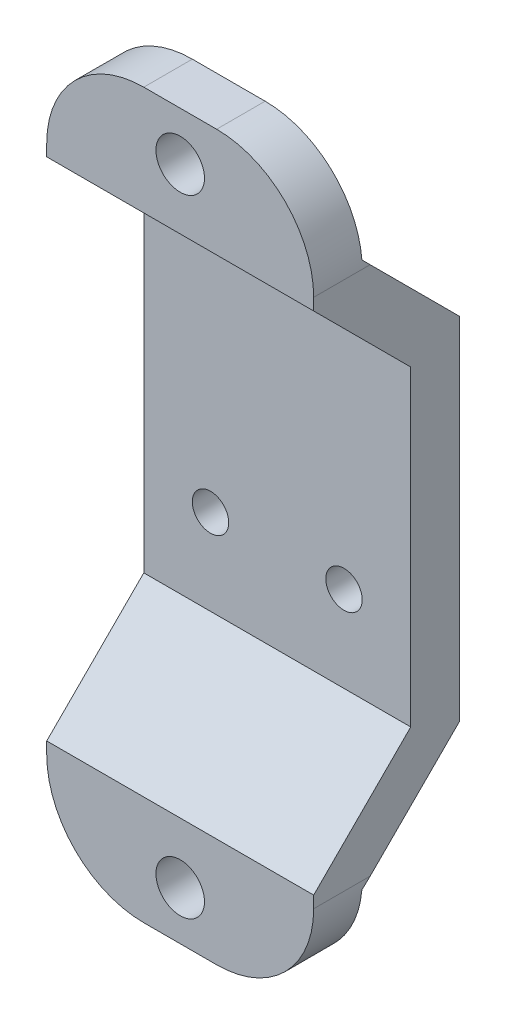
ISO-10303-21;
HEADER;
FILE_DESCRIPTION(('STEP AP214'),'2;1');
FILE_NAME('part.step','',(''),(''),'','','');
FILE_SCHEMA(('AUTOMOTIVE_DESIGN { 1 0 10303 214 1 1 1 1 }'));
ENDSEC;
DATA;
#1=APPLICATION_CONTEXT('core data for automotive mechanical design processes');
#2=APPLICATION_PROTOCOL_DEFINITION('international standard','automotive_design',2000,#1);
#3=PRODUCT_CONTEXT('',#1,'mechanical');
#4=PRODUCT('Part','Part','',(#3));
#5=PRODUCT_RELATED_PRODUCT_CATEGORY('part','',(#4));
#6=PRODUCT_DEFINITION_FORMATION('','',#4);
#7=PRODUCT_DEFINITION_CONTEXT('part definition',#1,'design');
#8=PRODUCT_DEFINITION('design','',#6,#7);
#9=PRODUCT_DEFINITION_SHAPE('','',#8);
#10=(LENGTH_UNIT() NAMED_UNIT(*) SI_UNIT(.MILLI.,.METRE.));
#11=(NAMED_UNIT(*) PLANE_ANGLE_UNIT() SI_UNIT($,.RADIAN.));
#12=(NAMED_UNIT(*) SI_UNIT($,.STERADIAN.) SOLID_ANGLE_UNIT());
#13=UNCERTAINTY_MEASURE_WITH_UNIT(LENGTH_MEASURE(1.E-05),#10,'distance_accuracy_value','');
#14=(GEOMETRIC_REPRESENTATION_CONTEXT(3) GLOBAL_UNCERTAINTY_ASSIGNED_CONTEXT((#13)) GLOBAL_UNIT_ASSIGNED_CONTEXT((#10,
#11,#12)) REPRESENTATION_CONTEXT('',''));
#15=CARTESIAN_POINT('',(0.,0.,0.));
#16=DIRECTION('',(0.,0.,1.));
#17=DIRECTION('',(1.,0.,0.));
#18=AXIS2_PLACEMENT_3D('',#15,#16,#17);
#19=CARTESIAN_POINT('',(-8.87222,-24.05126,1.61290000000002));
#20=DIRECTION('',(0.,0.,-1.));
#21=DIRECTION('',(0.,1.,0.));
#22=AXIS2_PLACEMENT_3D('',#19,#20,#21);
#23=PLANE('',#22);
#24=DIRECTION('',(1.,0.,0.));
#25=VECTOR('',#24,1.);
#26=CARTESIAN_POINT('',(-8.87222,-24.05126,1.61290000000002));
#27=LINE('',#26,#25);
#28=CARTESIAN_POINT('',(-2.42062,-24.05126,1.61290000000002));
#29=VERTEX_POINT('',#28);
#30=CARTESIAN_POINT('',(2.42062,-24.05126,1.61290000000002));
#31=VERTEX_POINT('',#30);
#32=EDGE_CURVE('E228',#29,#31,#27,.T.);
#33=ORIENTED_EDGE('',*,*,#32,.F.);
#34=CARTESIAN_POINT('',(-2.42062,-17.59966,1.61290000000001));
#35=DIRECTION('',(0.,0.,-1.));
#36=DIRECTION('',(0.,1.,0.));
#37=AXIS2_PLACEMENT_3D('',#34,#35,#36);
#38=CIRCLE('',#37,6.4516);
#39=CARTESIAN_POINT('',(-8.85055161220242,-18.12798,1.61290000000001));
#40=VERTEX_POINT('',#39);
#41=EDGE_CURVE('E243',#29,#40,#38,.T.);
#42=ORIENTED_EDGE('',*,*,#41,.T.);
#43=DIRECTION('',(1.,0.,0.));
#44=VECTOR('',#43,1.);
#45=CARTESIAN_POINT('',(-8.87222,-18.12798,1.61290000000001));
#46=LINE('',#45,#44);
#47=CARTESIAN_POINT('',(8.85055161220242,-18.12798,1.61290000000001));
#48=VERTEX_POINT('',#47);
#49=EDGE_CURVE('E225',#40,#48,#46,.T.);
#50=ORIENTED_EDGE('',*,*,#49,.T.);
#51=CARTESIAN_POINT('',(2.42062,-17.59966,1.61290000000001));
#52=DIRECTION('',(0.,0.,-1.));
#53=DIRECTION('',(0.,1.,0.));
#54=AXIS2_PLACEMENT_3D('',#51,#52,#53);
#55=CIRCLE('',#54,6.4516);
#56=EDGE_CURVE('E241',#48,#31,#55,.T.);
#57=ORIENTED_EDGE('',*,*,#56,.T.);
#58=EDGE_LOOP('',(#33,#42,#50,#57));
#59=FACE_BOUND('',#58,.T.);
#60=CARTESIAN_POINT('',(0.,-20.82546,1.61290000000002));
#61=DIRECTION('',(0.,0.,-1.));
#62=DIRECTION('',(0.,1.,0.));
#63=AXIS2_PLACEMENT_3D('',#60,#61,#62);
#64=CIRCLE('',#63,1.6129);
#65=CARTESIAN_POINT('',(0.,-19.21256,1.61290000000001));
#66=VERTEX_POINT('',#65);
#67=EDGE_CURVE('E407',#66,#66,#64,.F.);
#68=ORIENTED_EDGE('',*,*,#67,.T.);
#69=EDGE_LOOP('',(#68));
#70=FACE_BOUND('',#69,.T.);
#71=ADVANCED_FACE('F32',(#59,#70),#23,.T.);
#72=CARTESIAN_POINT('',(-8.87222,-24.05126,4.83870000000002));
#73=DIRECTION('',(0.,0.,1.));
#74=DIRECTION('',(0.,-1.,0.));
#75=AXIS2_PLACEMENT_3D('',#72,#73,#74);
#76=PLANE('',#75);
#77=DIRECTION('',(0.,-1.,0.));
#78=VECTOR('',#77,1.);
#79=CARTESIAN_POINT('',(-8.87222,-24.05126,4.83870000000002));
#80=LINE('',#79,#78);
#81=CARTESIAN_POINT('',(-8.87222,-16.81226,4.83870000000001));
#82=VERTEX_POINT('',#81);
#83=CARTESIAN_POINT('',(-8.87222,-17.59966,4.83870000000001));
#84=VERTEX_POINT('',#83);
#85=EDGE_CURVE('E199',#82,#84,#80,.T.);
#86=ORIENTED_EDGE('',*,*,#85,.T.);
#87=CARTESIAN_POINT('',(-2.42062,-17.59966,4.83870000000001));
#88=DIRECTION('',(0.,0.,1.));
#89=DIRECTION('',(0.,-1.,0.));
#90=AXIS2_PLACEMENT_3D('',#87,#88,#89);
#91=CIRCLE('',#90,6.4516);
#92=CARTESIAN_POINT('',(-2.42062,-24.05126,4.83870000000002));
#93=VERTEX_POINT('',#92);
#94=EDGE_CURVE('E255',#84,#93,#91,.T.);
#95=ORIENTED_EDGE('',*,*,#94,.T.);
#96=DIRECTION('',(1.,0.,0.));
#97=VECTOR('',#96,1.);
#98=CARTESIAN_POINT('',(-8.87222,-24.05126,4.83870000000002));
#99=LINE('',#98,#97);
#100=CARTESIAN_POINT('',(2.42062,-24.05126,4.83870000000002));
#101=VERTEX_POINT('',#100);
#102=EDGE_CURVE('E231',#93,#101,#99,.T.);
#103=ORIENTED_EDGE('',*,*,#102,.T.);
#104=CARTESIAN_POINT('',(2.42062,-17.59966,4.83870000000001));
#105=DIRECTION('',(0.,0.,1.));
#106=DIRECTION('',(0.,-1.,0.));
#107=AXIS2_PLACEMENT_3D('',#104,#105,#106);
#108=CIRCLE('',#107,6.4516);
#109=CARTESIAN_POINT('',(8.87222,-17.59966,4.83870000000001));
#110=VERTEX_POINT('',#109);
#111=EDGE_CURVE('E253',#101,#110,#108,.T.);
#112=ORIENTED_EDGE('',*,*,#111,.T.);
#113=DIRECTION('',(0.,-1.,0.));
#114=VECTOR('',#113,1.);
#115=CARTESIAN_POINT('',(8.87222,-24.05126,4.83870000000002));
#116=LINE('',#115,#114);
#117=CARTESIAN_POINT('',(8.87222,-16.81226,4.83870000000001));
#118=VERTEX_POINT('',#117);
#119=EDGE_CURVE('E182',#118,#110,#116,.T.);
#120=ORIENTED_EDGE('',*,*,#119,.F.);
#121=DIRECTION('',(1.,0.,0.));
#122=VECTOR('',#121,1.);
#123=CARTESIAN_POINT('',(-8.87222,-16.81226,4.83870000000001));
#124=LINE('',#123,#122);
#125=EDGE_CURVE('E234',#82,#118,#124,.T.);
#126=ORIENTED_EDGE('',*,*,#125,.F.);
#127=EDGE_LOOP('',(#86,#95,#103,#112,#120,#126));
#128=FACE_BOUND('',#127,.T.);
#129=CARTESIAN_POINT('',(0.,-20.82546,4.83870000000001));
#130=DIRECTION('',(0.,0.,-1.));
#131=DIRECTION('',(1.,0.,0.));
#132=AXIS2_PLACEMENT_3D('',#129,#130,#131);
#133=CIRCLE('',#132,1.6129);
#134=CARTESIAN_POINT('',(1.6129,-20.82546,4.83870000000001));
#135=VERTEX_POINT('',#134);
#136=EDGE_CURVE('E403',#135,#135,#133,.T.);
#137=ORIENTED_EDGE('',*,*,#136,.T.);
#138=EDGE_LOOP('',(#137));
#139=FACE_BOUND('',#138,.T.);
#140=ADVANCED_FACE('F297',(#128,#139),#76,.T.);
#141=CARTESIAN_POINT('',(-8.87222,10.36066,-1.61289999999999));
#142=DIRECTION('',(0.,-0.707106781186548,0.707106781186547));
#143=DIRECTION('',(0.,-0.707106781186547,-0.707106781186548));
#144=AXIS2_PLACEMENT_3D('',#141,#142,#143);
#145=PLANE('',#144);
#146=DIRECTION('',(1.,0.,0.));
#147=VECTOR('',#146,1.);
#148=CARTESIAN_POINT('',(-8.87222,10.36066,-1.61289999999999));
#149=LINE('',#148,#147);
#150=CARTESIAN_POINT('',(-8.87222,10.36066,-1.61289999999999));
#151=VERTEX_POINT('',#150);
#152=CARTESIAN_POINT('',(8.87222,10.36066,-1.61289999999999));
#153=VERTEX_POINT('',#152);
#154=EDGE_CURVE('E145',#151,#153,#149,.T.);
#155=ORIENTED_EDGE('',*,*,#154,.T.);
#156=DIRECTION('',(0.,-0.707106781186547,-0.707106781186548));
#157=VECTOR('',#156,1.);
#158=CARTESIAN_POINT('',(8.87222,10.36066,-1.61289999999999));
#159=LINE('',#158,#157);
#160=CARTESIAN_POINT('',(8.87222,16.81226,4.83870000000001));
#161=VERTEX_POINT('',#160);
#162=EDGE_CURVE('E150',#161,#153,#159,.T.);
#163=ORIENTED_EDGE('',*,*,#162,.F.);
#164=DIRECTION('',(1.,0.,0.));
#165=VECTOR('',#164,1.);
#166=CARTESIAN_POINT('',(-8.87222,16.81226,4.83870000000001));
#167=LINE('',#166,#165);
#168=CARTESIAN_POINT('',(-8.87222,16.81226,4.83870000000001));
#169=VERTEX_POINT('',#168);
#170=EDGE_CURVE('E210',#169,#161,#167,.T.);
#171=ORIENTED_EDGE('',*,*,#170,.F.);
#172=DIRECTION('',(0.,-0.707106781186547,-0.707106781186548));
#173=VECTOR('',#172,1.);
#174=CARTESIAN_POINT('',(-8.87222,10.36066,-1.61289999999999));
#175=LINE('',#174,#173);
#176=EDGE_CURVE('E152',#169,#151,#175,.T.);
#177=ORIENTED_EDGE('',*,*,#176,.T.);
#178=EDGE_LOOP('',(#155,#163,#171,#177));
#179=FACE_BOUND('',#178,.T.);
#180=ADVANCED_FACE('F147',(#179),#145,.T.);
#181=CARTESIAN_POINT('',(-8.87222,24.05126,4.83870000000002));
#182=DIRECTION('',(0.,0.,1.));
#183=DIRECTION('',(0.,-1.,0.));
#184=AXIS2_PLACEMENT_3D('',#181,#182,#183);
#185=PLANE('',#184);
#186=CARTESIAN_POINT('',(0.,20.82546,4.83870000000001));
#187=DIRECTION('',(0.,0.,1.));
#188=DIRECTION('',(1.,0.,0.));
#189=AXIS2_PLACEMENT_3D('',#186,#187,#188);
#190=CIRCLE('',#189,1.6129);
#191=CARTESIAN_POINT('',(1.6129,20.82546,4.83870000000001));
#192=VERTEX_POINT('',#191);
#193=EDGE_CURVE('E176',#192,#192,#190,.T.);
#194=ORIENTED_EDGE('',*,*,#193,.F.);
#195=EDGE_LOOP('',(#194));
#196=FACE_BOUND('',#195,.T.);
#197=DIRECTION('',(0.,-1.,0.));
#198=VECTOR('',#197,1.);
#199=CARTESIAN_POINT('',(8.87222,24.05126,4.83870000000002));
#200=LINE('',#199,#198);
#201=CARTESIAN_POINT('',(8.87222,17.59966,4.83870000000001));
#202=VERTEX_POINT('',#201);
#203=EDGE_CURVE('E171',#202,#161,#200,.T.);
#204=ORIENTED_EDGE('',*,*,#203,.F.);
#205=CARTESIAN_POINT('',(2.42062,17.59966,4.83870000000001));
#206=DIRECTION('',(0.,0.,1.));
#207=DIRECTION('',(0.,-1.,0.));
#208=AXIS2_PLACEMENT_3D('',#205,#206,#207);
#209=CIRCLE('',#208,6.4516);
#210=CARTESIAN_POINT('',(2.42062,24.05126,4.83870000000002));
#211=VERTEX_POINT('',#210);
#212=EDGE_CURVE('E264',#202,#211,#209,.T.);
#213=ORIENTED_EDGE('',*,*,#212,.T.);
#214=DIRECTION('',(1.,0.,0.));
#215=VECTOR('',#214,1.);
#216=CARTESIAN_POINT('',(-8.87222,24.05126,4.83870000000002));
#217=LINE('',#216,#215);
#218=CARTESIAN_POINT('',(-2.42062,24.05126,4.83870000000002));
#219=VERTEX_POINT('',#218);
#220=EDGE_CURVE('E213',#219,#211,#217,.T.);
#221=ORIENTED_EDGE('',*,*,#220,.F.);
#222=CARTESIAN_POINT('',(-2.42062,17.59966,4.83870000000001));
#223=DIRECTION('',(0.,0.,1.));
#224=DIRECTION('',(0.,-1.,0.));
#225=AXIS2_PLACEMENT_3D('',#222,#223,#224);
#226=CIRCLE('',#225,6.4516);
#227=CARTESIAN_POINT('',(-8.87222,17.59966,4.83870000000001));
#228=VERTEX_POINT('',#227);
#229=EDGE_CURVE('E262',#219,#228,#226,.T.);
#230=ORIENTED_EDGE('',*,*,#229,.T.);
#231=DIRECTION('',(0.,-1.,0.));
#232=VECTOR('',#231,1.);
#233=CARTESIAN_POINT('',(-8.87222,24.05126,4.83870000000002));
#234=LINE('',#233,#232);
#235=EDGE_CURVE('E157',#228,#169,#234,.T.);
#236=ORIENTED_EDGE('',*,*,#235,.T.);
#237=ORIENTED_EDGE('',*,*,#170,.T.);
#238=EDGE_LOOP('',(#204,#213,#221,#230,#236,#237));
#239=FACE_BOUND('',#238,.T.);
#240=ADVANCED_FACE('F285',(#196,#239),#185,.T.);
#241=CARTESIAN_POINT('',(-8.87222,24.05126,4.83870000000002));
#242=DIRECTION('',(0.,1.,0.));
#243=DIRECTION('',(0.,0.,1.));
#244=AXIS2_PLACEMENT_3D('',#241,#242,#243);
#245=PLANE('',#244);
#246=ORIENTED_EDGE('',*,*,#220,.T.);
#247=DIRECTION('',(0.,0.,1.));
#248=VECTOR('',#247,1.);
#249=CARTESIAN_POINT('',(2.42062,24.05126,4.83870000000002));
#250=LINE('',#249,#248);
#251=CARTESIAN_POINT('',(2.42062,24.05126,1.61290000000002));
#252=VERTEX_POINT('',#251);
#253=EDGE_CURVE('E269',#211,#252,#250,.F.);
#254=ORIENTED_EDGE('',*,*,#253,.T.);
#255=DIRECTION('',(1.,0.,0.));
#256=VECTOR('',#255,1.);
#257=CARTESIAN_POINT('',(-8.87222,24.05126,1.61290000000002));
#258=LINE('',#257,#256);
#259=CARTESIAN_POINT('',(-2.42062,24.05126,1.61290000000002));
#260=VERTEX_POINT('',#259);
#261=EDGE_CURVE('E216',#260,#252,#258,.T.);
#262=ORIENTED_EDGE('',*,*,#261,.F.);
#263=DIRECTION('',(0.,0.,1.));
#264=VECTOR('',#263,1.);
#265=CARTESIAN_POINT('',(-2.42062,24.05126,4.83870000000002));
#266=LINE('',#265,#264);
#267=EDGE_CURVE('E266',#260,#219,#266,.T.);
#268=ORIENTED_EDGE('',*,*,#267,.T.);
#269=EDGE_LOOP('',(#246,#254,#262,#268));
#270=FACE_BOUND('',#269,.T.);
#271=ADVANCED_FACE('F279',(#270),#245,.T.);
#272=CARTESIAN_POINT('',(-8.87222,24.05126,1.61290000000002));
#273=DIRECTION('',(0.,0.,-1.));
#274=DIRECTION('',(0.,1.,0.));
#275=AXIS2_PLACEMENT_3D('',#272,#273,#274);
#276=PLANE('',#275);
#277=CARTESIAN_POINT('',(0.,20.82546,1.61290000000002));
#278=DIRECTION('',(0.,0.,-1.));
#279=DIRECTION('',(0.,1.,0.));
#280=AXIS2_PLACEMENT_3D('',#277,#278,#279);
#281=CIRCLE('',#280,1.6129);
#282=CARTESIAN_POINT('',(0.,22.43836,1.61290000000002));
#283=VERTEX_POINT('',#282);
#284=EDGE_CURVE('E173',#283,#283,#281,.T.);
#285=ORIENTED_EDGE('',*,*,#284,.F.);
#286=EDGE_LOOP('',(#285));
#287=FACE_BOUND('',#286,.T.);
#288=ORIENTED_EDGE('',*,*,#261,.T.);
#289=CARTESIAN_POINT('',(2.42062,17.59966,1.61290000000001));
#290=DIRECTION('',(0.,0.,-1.));
#291=DIRECTION('',(0.,1.,0.));
#292=AXIS2_PLACEMENT_3D('',#289,#290,#291);
#293=CIRCLE('',#292,6.4516);
#294=CARTESIAN_POINT('',(8.85055161220242,18.12798,1.61290000000001));
#295=VERTEX_POINT('',#294);
#296=EDGE_CURVE('E47',#252,#295,#293,.T.);
#297=ORIENTED_EDGE('',*,*,#296,.T.);
#298=DIRECTION('',(1.,0.,0.));
#299=VECTOR('',#298,1.);
#300=CARTESIAN_POINT('',(-8.87222,18.12798,1.61290000000001));
#301=LINE('',#300,#299);
#302=CARTESIAN_POINT('',(-8.85055161220242,18.12798,1.61290000000001));
#303=VERTEX_POINT('',#302);
#304=EDGE_CURVE('E218',#303,#295,#301,.T.);
#305=ORIENTED_EDGE('',*,*,#304,.F.);
#306=CARTESIAN_POINT('',(-2.42062,17.59966,1.61290000000001));
#307=DIRECTION('',(0.,0.,-1.));
#308=DIRECTION('',(0.,1.,0.));
#309=AXIS2_PLACEMENT_3D('',#306,#307,#308);
#310=CIRCLE('',#309,6.4516);
#311=EDGE_CURVE('E271',#303,#260,#310,.T.);
#312=ORIENTED_EDGE('',*,*,#311,.T.);
#313=EDGE_LOOP('',(#288,#297,#305,#312));
#314=FACE_BOUND('',#313,.T.);
#315=ADVANCED_FACE('F275',(#287,#314),#276,.T.);
#316=CARTESIAN_POINT('',(-8.87222,11.67638,-4.83869999999999));
#317=DIRECTION('',(0.,0.707106781186548,-0.707106781186547));
#318=DIRECTION('',(0.,0.707106781186547,0.707106781186548));
#319=AXIS2_PLACEMENT_3D('',#316,#317,#318);
#320=PLANE('',#319);
#321=ORIENTED_EDGE('',*,*,#304,.T.);
#322=CARTESIAN_POINT('',(2.42062,17.59966,1.08458000000001));
#323=DIRECTION('',(0.,0.707106781186548,-0.707106781186547));
#324=DIRECTION('',(0.,0.707106781186547,0.707106781186548));
#325=AXIS2_PLACEMENT_3D('',#322,#323,#324);
#326=ELLIPSE('',#325,9.12394021900626,6.4516);
#327=CARTESIAN_POINT('',(8.87222,17.59966,1.08458000000001));
#328=VERTEX_POINT('',#327);
#329=EDGE_CURVE('E11',#295,#328,#326,.T.);
#330=ORIENTED_EDGE('',*,*,#329,.T.);
#331=DIRECTION('',(0.,0.707106781186547,0.707106781186548));
#332=VECTOR('',#331,1.);
#333=CARTESIAN_POINT('',(8.87222,11.67638,-4.83869999999999));
#334=LINE('',#333,#332);
#335=CARTESIAN_POINT('',(8.87222,11.67638,-4.83869999999999));
#336=VERTEX_POINT('',#335);
#337=EDGE_CURVE('E189',#336,#328,#334,.T.);
#338=ORIENTED_EDGE('',*,*,#337,.F.);
#339=DIRECTION('',(1.,0.,0.));
#340=VECTOR('',#339,1.);
#341=CARTESIAN_POINT('',(-8.87222,11.67638,-4.83869999999999));
#342=LINE('',#341,#340);
#343=CARTESIAN_POINT('',(-8.87222,11.67638,-4.83869999999999));
#344=VERTEX_POINT('',#343);
#345=EDGE_CURVE('E220',#344,#336,#342,.T.);
#346=ORIENTED_EDGE('',*,*,#345,.F.);
#347=DIRECTION('',(0.,0.707106781186547,0.707106781186548));
#348=VECTOR('',#347,1.);
#349=CARTESIAN_POINT('',(-8.87222,11.67638,-4.83869999999999));
#350=LINE('',#349,#348);
#351=CARTESIAN_POINT('',(-8.87222,17.59966,1.08458000000001));
#352=VERTEX_POINT('',#351);
#353=EDGE_CURVE('E207',#344,#352,#350,.T.);
#354=ORIENTED_EDGE('',*,*,#353,.T.);
#355=CARTESIAN_POINT('',(-2.42062,17.59966,1.08458000000001));
#356=DIRECTION('',(0.,0.707106781186548,-0.707106781186547));
#357=DIRECTION('',(0.,-0.707106781186547,-0.707106781186548));
#358=AXIS2_PLACEMENT_3D('',#355,#356,#357);
#359=ELLIPSE('',#358,9.12394021900626,6.4516);
#360=EDGE_CURVE('E40',#352,#303,#359,.T.);
#361=ORIENTED_EDGE('',*,*,#360,.T.);
#362=EDGE_LOOP('',(#321,#330,#338,#346,#354,#361));
#363=FACE_BOUND('',#362,.T.);
#364=ADVANCED_FACE('F316',(#363),#320,.T.);
#365=CARTESIAN_POINT('',(-8.87222,-11.67638,-4.83869999999999));
#366=DIRECTION('',(0.,0.,-1.));
#367=DIRECTION('',(-1.,0.,0.));
#368=AXIS2_PLACEMENT_3D('',#365,#366,#367);
#369=PLANE('',#368);
#370=CARTESIAN_POINT('',(4.43611,-4.65327999999999,-4.83869999999999));
#371=DIRECTION('',(0.,0.,1.));
#372=DIRECTION('',(1.,0.,0.));
#373=AXIS2_PLACEMENT_3D('',#370,#371,#372);
#374=CIRCLE('',#373,1.20904);
#375=CARTESIAN_POINT('',(5.64515,-4.65327999999999,-4.83869999999999));
#376=VERTEX_POINT('',#375);
#377=EDGE_CURVE('E399',#376,#376,#374,.T.);
#378=ORIENTED_EDGE('',*,*,#377,.T.);
#379=EDGE_LOOP('',(#378));
#380=FACE_BOUND('',#379,.T.);
#381=CARTESIAN_POINT('',(-4.43611,-4.65327999999999,-4.83869999999999));
#382=DIRECTION('',(0.,0.,1.));
#383=DIRECTION('',(1.,0.,0.));
#384=AXIS2_PLACEMENT_3D('',#381,#382,#383);
#385=CIRCLE('',#384,1.20904);
#386=CARTESIAN_POINT('',(-3.22707,-4.65327999999999,-4.83869999999999));
#387=VERTEX_POINT('',#386);
#388=EDGE_CURVE('E402',#387,#387,#385,.T.);
#389=ORIENTED_EDGE('',*,*,#388,.T.);
#390=EDGE_LOOP('',(#389));
#391=FACE_BOUND('',#390,.T.);
#392=ORIENTED_EDGE('',*,*,#345,.T.);
#393=DIRECTION('',(0.,1.,0.));
#394=VECTOR('',#393,1.);
#395=CARTESIAN_POINT('',(8.87222,-11.67638,-4.83869999999999));
#396=LINE('',#395,#394);
#397=CARTESIAN_POINT('',(8.87222,-11.67638,-4.83869999999999));
#398=VERTEX_POINT('',#397);
#399=EDGE_CURVE('E186',#398,#336,#396,.T.);
#400=ORIENTED_EDGE('',*,*,#399,.F.);
#401=DIRECTION('',(1.,0.,0.));
#402=VECTOR('',#401,1.);
#403=CARTESIAN_POINT('',(-8.87222,-11.67638,-4.83869999999999));
#404=LINE('',#403,#402);
#405=CARTESIAN_POINT('',(-8.87222,-11.67638,-4.83869999999999));
#406=VERTEX_POINT('',#405);
#407=EDGE_CURVE('E222',#406,#398,#404,.T.);
#408=ORIENTED_EDGE('',*,*,#407,.F.);
#409=DIRECTION('',(0.,1.,0.));
#410=VECTOR('',#409,1.);
#411=CARTESIAN_POINT('',(-8.87222,-11.67638,-4.83869999999999));
#412=LINE('',#411,#410);
#413=EDGE_CURVE('E204',#406,#344,#412,.T.);
#414=ORIENTED_EDGE('',*,*,#413,.T.);
#415=EDGE_LOOP('',(#392,#400,#408,#414));
#416=FACE_BOUND('',#415,.T.);
#417=ADVANCED_FACE('F313',(#380,#391,#416),#369,.T.);
#418=CARTESIAN_POINT('',(-8.87222,-11.67638,-4.83869999999999));
#419=DIRECTION('',(0.,-0.707106781186548,-0.707106781186547));
#420=DIRECTION('',(0.,0.707106781186547,-0.707106781186548));
#421=AXIS2_PLACEMENT_3D('',#418,#419,#420);
#422=PLANE('',#421);
#423=ORIENTED_EDGE('',*,*,#49,.F.);
#424=CARTESIAN_POINT('',(-2.42062,-17.59966,1.08458000000001));
#425=DIRECTION('',(0.,-0.707106781186548,-0.707106781186547));
#426=DIRECTION('',(0.,-0.707106781186547,0.707106781186548));
#427=AXIS2_PLACEMENT_3D('',#424,#425,#426);
#428=ELLIPSE('',#427,9.12394021900626,6.4516);
#429=CARTESIAN_POINT('',(-8.87222,-17.59966,1.08458000000001));
#430=VERTEX_POINT('',#429);
#431=EDGE_CURVE('E247',#40,#430,#428,.T.);
#432=ORIENTED_EDGE('',*,*,#431,.T.);
#433=DIRECTION('',(0.,0.707106781186547,-0.707106781186548));
#434=VECTOR('',#433,1.);
#435=CARTESIAN_POINT('',(-8.87222,-11.67638,-4.83869999999999));
#436=LINE('',#435,#434);
#437=EDGE_CURVE('E202',#430,#406,#436,.T.);
#438=ORIENTED_EDGE('',*,*,#437,.T.);
#439=ORIENTED_EDGE('',*,*,#407,.T.);
#440=DIRECTION('',(0.,0.707106781186547,-0.707106781186548));
#441=VECTOR('',#440,1.);
#442=CARTESIAN_POINT('',(8.87222,-11.67638,-4.83869999999999));
#443=LINE('',#442,#441);
#444=CARTESIAN_POINT('',(8.87222,-17.59966,1.08458000000001));
#445=VERTEX_POINT('',#444);
#446=EDGE_CURVE('E184',#445,#398,#443,.T.);
#447=ORIENTED_EDGE('',*,*,#446,.F.);
#448=CARTESIAN_POINT('',(2.42062,-17.59966,1.08458000000001));
#449=DIRECTION('',(0.,-0.707106781186548,-0.707106781186547));
#450=DIRECTION('',(0.,0.707106781186547,-0.707106781186548));
#451=AXIS2_PLACEMENT_3D('',#448,#449,#450);
#452=ELLIPSE('',#451,9.12394021900626,6.4516);
#453=EDGE_CURVE('E245',#445,#48,#452,.T.);
#454=ORIENTED_EDGE('',*,*,#453,.T.);
#455=EDGE_LOOP('',(#423,#432,#438,#439,#447,#454));
#456=FACE_BOUND('',#455,.T.);
#457=ADVANCED_FACE('F308',(#456),#422,.T.);
#458=CARTESIAN_POINT('',(-8.87222,-24.05126,4.83870000000002));
#459=DIRECTION('',(0.,-1.,0.));
#460=DIRECTION('',(0.,0.,-1.));
#461=AXIS2_PLACEMENT_3D('',#458,#459,#460);
#462=PLANE('',#461);
#463=ORIENTED_EDGE('',*,*,#102,.F.);
#464=DIRECTION('',(0.,0.,-1.));
#465=VECTOR('',#464,1.);
#466=CARTESIAN_POINT('',(-2.42062,-24.05126,1.61290000000002));
#467=LINE('',#466,#465);
#468=EDGE_CURVE('E238',#93,#29,#467,.T.);
#469=ORIENTED_EDGE('',*,*,#468,.T.);
#470=ORIENTED_EDGE('',*,*,#32,.T.);
#471=DIRECTION('',(0.,0.,-1.));
#472=VECTOR('',#471,1.);
#473=CARTESIAN_POINT('',(2.42062,-24.05126,4.83870000000002));
#474=LINE('',#473,#472);
#475=EDGE_CURVE('E212',#31,#101,#474,.F.);
#476=ORIENTED_EDGE('',*,*,#475,.T.);
#477=EDGE_LOOP('',(#463,#469,#470,#476));
#478=FACE_BOUND('',#477,.T.);
#479=ADVANCED_FACE('F339',(#478),#462,.T.);
#480=CARTESIAN_POINT('',(-8.87222,-10.36066,-1.61289999999999));
#481=DIRECTION('',(0.,0.707106781186548,0.707106781186547));
#482=DIRECTION('',(0.,-0.707106781186547,0.707106781186548));
#483=AXIS2_PLACEMENT_3D('',#480,#481,#482);
#484=PLANE('',#483);
#485=ORIENTED_EDGE('',*,*,#125,.T.);
#486=DIRECTION('',(0.,-0.707106781186547,0.707106781186548));
#487=VECTOR('',#486,1.);
#488=CARTESIAN_POINT('',(8.87222,-10.36066,-1.61289999999999));
#489=LINE('',#488,#487);
#490=CARTESIAN_POINT('',(8.87222,-10.36066,-1.61289999999999));
#491=VERTEX_POINT('',#490);
#492=EDGE_CURVE('E165',#491,#118,#489,.T.);
#493=ORIENTED_EDGE('',*,*,#492,.F.);
#494=DIRECTION('',(1.,0.,0.));
#495=VECTOR('',#494,1.);
#496=CARTESIAN_POINT('',(-8.87222,-10.36066,-1.61289999999999));
#497=LINE('',#496,#495);
#498=CARTESIAN_POINT('',(-8.87222,-10.36066,-1.61289999999999));
#499=VERTEX_POINT('',#498);
#500=EDGE_CURVE('E156',#499,#491,#497,.T.);
#501=ORIENTED_EDGE('',*,*,#500,.F.);
#502=DIRECTION('',(0.,-0.707106781186547,0.707106781186548));
#503=VECTOR('',#502,1.);
#504=CARTESIAN_POINT('',(-8.87222,-10.36066,-1.61289999999999));
#505=LINE('',#504,#503);
#506=EDGE_CURVE('E196',#499,#82,#505,.T.);
#507=ORIENTED_EDGE('',*,*,#506,.T.);
#508=EDGE_LOOP('',(#485,#493,#501,#507));
#509=FACE_BOUND('',#508,.T.);
#510=ADVANCED_FACE('F293',(#509),#484,.T.);
#511=CARTESIAN_POINT('',(-8.87222,-10.36066,-1.61289999999999));
#512=DIRECTION('',(0.,0.,1.));
#513=DIRECTION('',(1.,0.,0.));
#514=AXIS2_PLACEMENT_3D('',#511,#512,#513);
#515=PLANE('',#514);
#516=CARTESIAN_POINT('',(4.43611,-4.65327999999999,-1.61289999999999));
#517=DIRECTION('',(0.,0.,1.));
#518=DIRECTION('',(1.,0.,0.));
#519=AXIS2_PLACEMENT_3D('',#516,#517,#518);
#520=CIRCLE('',#519,1.20904);
#521=CARTESIAN_POINT('',(5.64515,-4.65327999999999,-1.61289999999999));
#522=VERTEX_POINT('',#521);
#523=EDGE_CURVE('E412',#522,#522,#520,.T.);
#524=ORIENTED_EDGE('',*,*,#523,.F.);
#525=EDGE_LOOP('',(#524));
#526=FACE_BOUND('',#525,.T.);
#527=CARTESIAN_POINT('',(-4.43611,-4.65327999999999,-1.61289999999999));
#528=DIRECTION('',(0.,0.,1.));
#529=DIRECTION('',(1.,0.,0.));
#530=AXIS2_PLACEMENT_3D('',#527,#528,#529);
#531=CIRCLE('',#530,1.20904);
#532=CARTESIAN_POINT('',(-3.22707,-4.65327999999999,-1.61289999999999));
#533=VERTEX_POINT('',#532);
#534=EDGE_CURVE('E404',#533,#533,#531,.T.);
#535=ORIENTED_EDGE('',*,*,#534,.F.);
#536=EDGE_LOOP('',(#535));
#537=FACE_BOUND('',#536,.T.);
#538=ORIENTED_EDGE('',*,*,#500,.T.);
#539=DIRECTION('',(0.,-1.,0.));
#540=VECTOR('',#539,1.);
#541=CARTESIAN_POINT('',(8.87222,-10.36066,-1.61289999999999));
#542=LINE('',#541,#540);
#543=EDGE_CURVE('E160',#153,#491,#542,.T.);
#544=ORIENTED_EDGE('',*,*,#543,.F.);
#545=ORIENTED_EDGE('',*,*,#154,.F.);
#546=DIRECTION('',(0.,-1.,0.));
#547=VECTOR('',#546,1.);
#548=CARTESIAN_POINT('',(-8.87222,-10.36066,-1.61289999999999));
#549=LINE('',#548,#547);
#550=EDGE_CURVE('E194',#151,#499,#549,.T.);
#551=ORIENTED_EDGE('',*,*,#550,.T.);
#552=EDGE_LOOP('',(#538,#544,#545,#551));
#553=FACE_BOUND('',#552,.T.);
#554=ADVANCED_FACE('F161',(#526,#537,#553),#515,.T.);
#555=CARTESIAN_POINT('',(-8.87222,0.,0.));
#556=DIRECTION('',(1.,0.,0.));
#557=DIRECTION('',(0.,0.,-1.));
#558=AXIS2_PLACEMENT_3D('',#555,#556,#557);
#559=PLANE('',#558);
#560=ORIENTED_EDGE('',*,*,#437,.F.);
#561=DIRECTION('',(0.,0.,-1.));
#562=VECTOR('',#561,1.);
#563=CARTESIAN_POINT('',(-8.87222,-17.59966,4.83870000000002));
#564=LINE('',#563,#562);
#565=EDGE_CURVE('E251',#430,#84,#564,.F.);
#566=ORIENTED_EDGE('',*,*,#565,.T.);
#567=ORIENTED_EDGE('',*,*,#85,.F.);
#568=ORIENTED_EDGE('',*,*,#506,.F.);
#569=ORIENTED_EDGE('',*,*,#550,.F.);
#570=ORIENTED_EDGE('',*,*,#176,.F.);
#571=ORIENTED_EDGE('',*,*,#235,.F.);
#572=DIRECTION('',(0.,0.,1.));
#573=VECTOR('',#572,1.);
#574=CARTESIAN_POINT('',(-8.87222,17.59966,1.61290000000002));
#575=LINE('',#574,#573);
#576=EDGE_CURVE('E249',#228,#352,#575,.F.);
#577=ORIENTED_EDGE('',*,*,#576,.T.);
#578=ORIENTED_EDGE('',*,*,#353,.F.);
#579=ORIENTED_EDGE('',*,*,#413,.F.);
#580=EDGE_LOOP('',(#560,#566,#567,#568,#569,#570,#571,#577,#578,#579));
#581=FACE_BOUND('',#580,.T.);
#582=ADVANCED_FACE('F288',(#581),#559,.F.);
#583=CARTESIAN_POINT('',(8.87222,0.,0.));
#584=DIRECTION('',(1.,0.,0.));
#585=DIRECTION('',(0.,0.,-1.));
#586=AXIS2_PLACEMENT_3D('',#583,#584,#585);
#587=PLANE('',#586);
#588=ORIENTED_EDGE('',*,*,#119,.T.);
#589=DIRECTION('',(0.,0.,-1.));
#590=VECTOR('',#589,1.);
#591=CARTESIAN_POINT('',(8.87222,-17.59966,0.));
#592=LINE('',#591,#590);
#593=EDGE_CURVE('E259',#110,#445,#592,.T.);
#594=ORIENTED_EDGE('',*,*,#593,.T.);
#595=ORIENTED_EDGE('',*,*,#446,.T.);
#596=ORIENTED_EDGE('',*,*,#399,.T.);
#597=ORIENTED_EDGE('',*,*,#337,.T.);
#598=DIRECTION('',(0.,0.,1.));
#599=VECTOR('',#598,1.);
#600=CARTESIAN_POINT('',(8.87222,17.59966,0.));
#601=LINE('',#600,#599);
#602=EDGE_CURVE('E257',#328,#202,#601,.T.);
#603=ORIENTED_EDGE('',*,*,#602,.T.);
#604=ORIENTED_EDGE('',*,*,#203,.T.);
#605=ORIENTED_EDGE('',*,*,#162,.T.);
#606=ORIENTED_EDGE('',*,*,#543,.T.);
#607=ORIENTED_EDGE('',*,*,#492,.T.);
#608=EDGE_LOOP('',(#588,#594,#595,#596,#597,#603,#604,#605,#606,#607));
#609=FACE_BOUND('',#608,.T.);
#610=ADVANCED_FACE('F168',(#609),#587,.T.);
#611=CARTESIAN_POINT('',(0.,20.82546,-4.83869999999999));
#612=DIRECTION('',(0.,0.,1.));
#613=DIRECTION('',(1.,0.,0.));
#614=AXIS2_PLACEMENT_3D('',#611,#612,#613);
#615=CYLINDRICAL_SURFACE('',#614,1.6129);
#616=ORIENTED_EDGE('',*,*,#284,.T.);
#617=EDGE_LOOP('',(#616));
#618=FACE_BOUND('',#617,.T.);
#619=ORIENTED_EDGE('',*,*,#193,.T.);
#620=EDGE_LOOP('',(#619));
#621=FACE_BOUND('',#620,.T.);
#622=ADVANCED_FACE('F374',(#618,#621),#615,.F.);
#623=CARTESIAN_POINT('',(0.,-20.82546,-4.83869999999999));
#624=DIRECTION('',(0.,0.,1.));
#625=DIRECTION('',(1.,0.,0.));
#626=AXIS2_PLACEMENT_3D('',#623,#624,#625);
#627=CYLINDRICAL_SURFACE('',#626,1.6129);
#628=ORIENTED_EDGE('',*,*,#67,.F.);
#629=EDGE_LOOP('',(#628));
#630=FACE_BOUND('',#629,.T.);
#631=ORIENTED_EDGE('',*,*,#136,.F.);
#632=EDGE_LOOP('',(#631));
#633=FACE_BOUND('',#632,.T.);
#634=ADVANCED_FACE('F366',(#630,#633),#627,.F.);
#635=CARTESIAN_POINT('',(-4.43611,-4.65327999999999,-4.83869999999999));
#636=DIRECTION('',(0.,0.,1.));
#637=DIRECTION('',(1.,0.,0.));
#638=AXIS2_PLACEMENT_3D('',#635,#636,#637);
#639=CYLINDRICAL_SURFACE('',#638,1.20904);
#640=ORIENTED_EDGE('',*,*,#388,.F.);
#641=EDGE_LOOP('',(#640));
#642=FACE_BOUND('',#641,.T.);
#643=ORIENTED_EDGE('',*,*,#534,.T.);
#644=EDGE_LOOP('',(#643));
#645=FACE_BOUND('',#644,.T.);
#646=ADVANCED_FACE('F356',(#642,#645),#639,.F.);
#647=CARTESIAN_POINT('',(4.43611,-4.65327999999999,-4.83869999999999));
#648=DIRECTION('',(0.,0.,1.));
#649=DIRECTION('',(1.,0.,0.));
#650=AXIS2_PLACEMENT_3D('',#647,#648,#649);
#651=CYLINDRICAL_SURFACE('',#650,1.20904);
#652=ORIENTED_EDGE('',*,*,#377,.F.);
#653=EDGE_LOOP('',(#652));
#654=FACE_BOUND('',#653,.T.);
#655=ORIENTED_EDGE('',*,*,#523,.T.);
#656=EDGE_LOOP('',(#655));
#657=FACE_BOUND('',#656,.T.);
#658=ADVANCED_FACE('F351',(#654,#657),#651,.F.);
#659=CARTESIAN_POINT('',(-2.42062,-17.59966,4.83870000000002));
#660=DIRECTION('',(0.,0.,1.));
#661=DIRECTION('',(1.,0.,0.));
#662=AXIS2_PLACEMENT_3D('',#659,#660,#661);
#663=CYLINDRICAL_SURFACE('',#662,6.4516);
#664=ORIENTED_EDGE('',*,*,#94,.F.);
#665=ORIENTED_EDGE('',*,*,#565,.F.);
#666=ORIENTED_EDGE('',*,*,#431,.F.);
#667=ORIENTED_EDGE('',*,*,#41,.F.);
#668=ORIENTED_EDGE('',*,*,#468,.F.);
#669=EDGE_LOOP('',(#664,#665,#666,#667,#668));
#670=FACE_BOUND('',#669,.T.);
#671=ADVANCED_FACE('F325',(#670),#663,.T.);
#672=CARTESIAN_POINT('',(2.42062,-17.59966,0.));
#673=DIRECTION('',(0.,0.,-1.));
#674=DIRECTION('',(-1.,0.,0.));
#675=AXIS2_PLACEMENT_3D('',#672,#673,#674);
#676=CYLINDRICAL_SURFACE('',#675,6.4516);
#677=ORIENTED_EDGE('',*,*,#111,.F.);
#678=ORIENTED_EDGE('',*,*,#475,.F.);
#679=ORIENTED_EDGE('',*,*,#56,.F.);
#680=ORIENTED_EDGE('',*,*,#453,.F.);
#681=ORIENTED_EDGE('',*,*,#593,.F.);
#682=EDGE_LOOP('',(#677,#678,#679,#680,#681));
#683=FACE_BOUND('',#682,.T.);
#684=ADVANCED_FACE('F303',(#683),#676,.T.);
#685=CARTESIAN_POINT('',(2.42062,17.59966,0.));
#686=DIRECTION('',(0.,0.,1.));
#687=DIRECTION('',(1.,0.,0.));
#688=AXIS2_PLACEMENT_3D('',#685,#686,#687);
#689=CYLINDRICAL_SURFACE('',#688,6.4516);
#690=ORIENTED_EDGE('',*,*,#296,.F.);
#691=ORIENTED_EDGE('',*,*,#253,.F.);
#692=ORIENTED_EDGE('',*,*,#212,.F.);
#693=ORIENTED_EDGE('',*,*,#602,.F.);
#694=ORIENTED_EDGE('',*,*,#329,.F.);
#695=EDGE_LOOP('',(#690,#691,#692,#693,#694));
#696=FACE_BOUND('',#695,.T.);
#697=ADVANCED_FACE('F319',(#696),#689,.T.);
#698=CARTESIAN_POINT('',(-2.42062,17.59966,4.83870000000002));
#699=DIRECTION('',(0.,0.,-1.));
#700=DIRECTION('',(-1.,0.,0.));
#701=AXIS2_PLACEMENT_3D('',#698,#699,#700);
#702=CYLINDRICAL_SURFACE('',#701,6.4516);
#703=ORIENTED_EDGE('',*,*,#360,.F.);
#704=ORIENTED_EDGE('',*,*,#576,.F.);
#705=ORIENTED_EDGE('',*,*,#229,.F.);
#706=ORIENTED_EDGE('',*,*,#267,.F.);
#707=ORIENTED_EDGE('',*,*,#311,.F.);
#708=EDGE_LOOP('',(#703,#704,#705,#706,#707));
#709=FACE_BOUND('',#708,.T.);
#710=ADVANCED_FACE('F34',(#709),#702,.T.);
#711=CLOSED_SHELL('',(#71,#140,#180,#240,#271,#315,#364,#417,#457,#479,#510,#554,#582,#610,#622,
#634,#646,#658,#671,#684,#697,#710));
#712=MANIFOLD_SOLID_BREP('B2',#711);
#713=ADVANCED_BREP_SHAPE_REPRESENTATION('',(#18,#712),#14);
#714=SHAPE_DEFINITION_REPRESENTATION(#9,#713);
ENDSEC;
END-ISO-10303-21;
